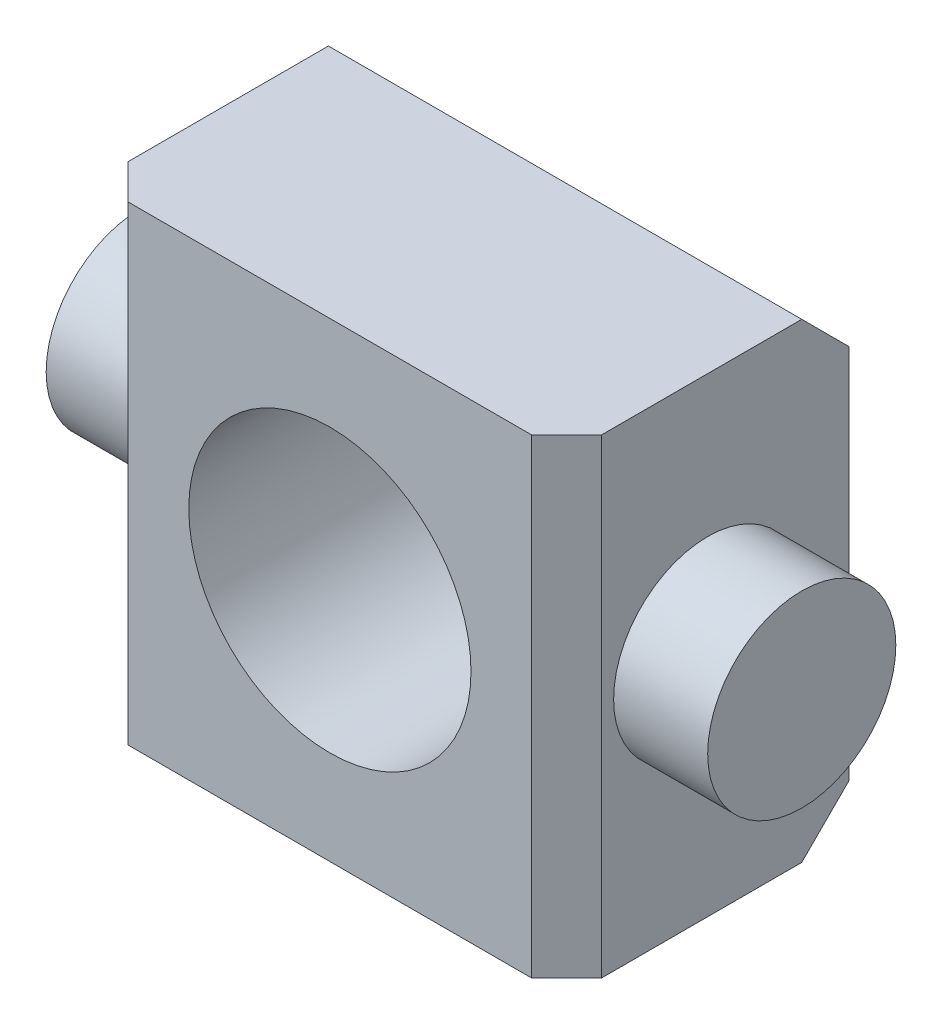
ISO-10303-21;
HEADER;
FILE_DESCRIPTION(('STEP AP214'),'2;1');
FILE_NAME('part.step','',(''),(''),'','','');
FILE_SCHEMA(('AUTOMOTIVE_DESIGN { 1 0 10303 214 1 1 1 1 }'));
ENDSEC;
DATA;
#1=APPLICATION_CONTEXT('core data for automotive mechanical design processes');
#2=APPLICATION_PROTOCOL_DEFINITION('international standard','automotive_design',2000,#1);
#3=PRODUCT_CONTEXT('',#1,'mechanical');
#4=PRODUCT('Part','Part','',(#3));
#5=PRODUCT_RELATED_PRODUCT_CATEGORY('part','',(#4));
#6=PRODUCT_DEFINITION_FORMATION('','',#4);
#7=PRODUCT_DEFINITION_CONTEXT('part definition',#1,'design');
#8=PRODUCT_DEFINITION('design','',#6,#7);
#9=PRODUCT_DEFINITION_SHAPE('','',#8);
#10=(LENGTH_UNIT() NAMED_UNIT(*) SI_UNIT(.MILLI.,.METRE.));
#11=(NAMED_UNIT(*) PLANE_ANGLE_UNIT() SI_UNIT($,.RADIAN.));
#12=(NAMED_UNIT(*) SI_UNIT($,.STERADIAN.) SOLID_ANGLE_UNIT());
#13=UNCERTAINTY_MEASURE_WITH_UNIT(LENGTH_MEASURE(1.E-05),#10,'distance_accuracy_value','');
#14=(GEOMETRIC_REPRESENTATION_CONTEXT(3) GLOBAL_UNCERTAINTY_ASSIGNED_CONTEXT((#13)) GLOBAL_UNIT_ASSIGNED_CONTEXT((#10,
#11,#12)) REPRESENTATION_CONTEXT('',''));
#15=CARTESIAN_POINT('',(0.,0.,0.));
#16=DIRECTION('',(0.,0.,1.));
#17=DIRECTION('',(1.,0.,0.));
#18=AXIS2_PLACEMENT_3D('',#15,#16,#17);
#19=CARTESIAN_POINT('',(-15.9766,15.875,9.525));
#20=DIRECTION('',(1.,0.,0.));
#21=DIRECTION('',(0.,1.,0.));
#22=AXIS2_PLACEMENT_3D('',#19,#20,#21);
#23=PLANE('',#22);
#24=DIRECTION('',(0.,0.,-1.));
#25=VECTOR('',#24,1.);
#26=CARTESIAN_POINT('',(-15.9766,-15.875,9.525));
#27=LINE('',#26,#25);
#28=CARTESIAN_POINT('',(-15.9766,-15.875,7.16279999999999));
#29=VERTEX_POINT('',#28);
#30=CARTESIAN_POINT('',(-15.9766,-15.875,-6.35));
#31=VERTEX_POINT('',#30);
#32=EDGE_CURVE('E129',#29,#31,#27,.T.);
#33=ORIENTED_EDGE('',*,*,#32,.F.);
#34=DIRECTION('',(0.,1.,0.));
#35=VECTOR('',#34,1.);
#36=CARTESIAN_POINT('',(-15.9766,15.875,7.16279999999999));
#37=LINE('',#36,#35);
#38=CARTESIAN_POINT('',(-15.9766,15.875,7.16279999999999));
#39=VERTEX_POINT('',#38);
#40=EDGE_CURVE('E11',#29,#39,#37,.T.);
#41=ORIENTED_EDGE('',*,*,#40,.T.);
#42=DIRECTION('',(0.,0.,-1.));
#43=VECTOR('',#42,1.);
#44=CARTESIAN_POINT('',(-15.9766,15.875,9.525));
#45=LINE('',#44,#43);
#46=CARTESIAN_POINT('',(-15.9766,15.875,-6.35));
#47=VERTEX_POINT('',#46);
#48=EDGE_CURVE('E98',#39,#47,#45,.T.);
#49=ORIENTED_EDGE('',*,*,#48,.T.);
#50=DIRECTION('',(0.,0.707106781186549,0.707106781186546));
#51=VECTOR('',#50,1.);
#52=CARTESIAN_POINT('',(-15.9766,15.875,-6.35));
#53=LINE('',#52,#51);
#54=CARTESIAN_POINT('',(-15.9766,12.7,-9.525));
#55=VERTEX_POINT('',#54);
#56=EDGE_CURVE('E102',#47,#55,#53,.F.);
#57=ORIENTED_EDGE('',*,*,#56,.T.);
#58=DIRECTION('',(0.,-1.,0.));
#59=VECTOR('',#58,1.);
#60=CARTESIAN_POINT('',(-15.9766,15.875,-9.525));
#61=LINE('',#60,#59);
#62=CARTESIAN_POINT('',(-15.9766,-12.7,-9.525));
#63=VERTEX_POINT('',#62);
#64=EDGE_CURVE('E174',#55,#63,#61,.T.);
#65=ORIENTED_EDGE('',*,*,#64,.T.);
#66=DIRECTION('',(0.,0.707106781186549,-0.707106781186546));
#67=VECTOR('',#66,1.);
#68=CARTESIAN_POINT('',(-15.9766,-15.875,-6.35));
#69=LINE('',#68,#67);
#70=EDGE_CURVE('E119',#63,#31,#69,.F.);
#71=ORIENTED_EDGE('',*,*,#70,.T.);
#72=EDGE_LOOP('',(#33,#41,#49,#57,#65,#71));
#73=FACE_BOUND('',#72,.T.);
#74=CARTESIAN_POINT('',(-15.9766,0.,0.));
#75=DIRECTION('',(1.,0.,0.));
#76=DIRECTION('',(0.,1.,0.));
#77=AXIS2_PLACEMENT_3D('',#74,#75,#76);
#78=CIRCLE('',#77,6.35);
#79=CARTESIAN_POINT('',(-15.9766,6.35,0.));
#80=VERTEX_POINT('',#79);
#81=EDGE_CURVE('E124',#80,#80,#78,.F.);
#82=ORIENTED_EDGE('',*,*,#81,.F.);
#83=EDGE_LOOP('',(#82));
#84=FACE_BOUND('',#83,.T.);
#85=ADVANCED_FACE('F34',(#73,#84),#23,.F.);
#86=CARTESIAN_POINT('',(-15.9766,-15.875,9.525));
#87=DIRECTION('',(0.,1.,0.));
#88=DIRECTION('',(0.,0.,1.));
#89=AXIS2_PLACEMENT_3D('',#86,#87,#88);
#90=PLANE('',#89);
#91=DIRECTION('',(0.,0.,-1.));
#92=VECTOR('',#91,1.);
#93=CARTESIAN_POINT('',(15.9766,-15.875,9.525));
#94=LINE('',#93,#92);
#95=CARTESIAN_POINT('',(15.9766,-15.875,7.16279999999999));
#96=VERTEX_POINT('',#95);
#97=CARTESIAN_POINT('',(15.9766,-15.875,-6.35));
#98=VERTEX_POINT('',#97);
#99=EDGE_CURVE('E157',#96,#98,#94,.T.);
#100=ORIENTED_EDGE('',*,*,#99,.F.);
#101=DIRECTION('',(-0.707106781186547,0.,0.707106781186547));
#102=VECTOR('',#101,1.);
#103=CARTESIAN_POINT('',(13.6144,-15.875,9.525));
#104=LINE('',#103,#102);
#105=CARTESIAN_POINT('',(13.6144,-15.875,9.525));
#106=VERTEX_POINT('',#105);
#107=EDGE_CURVE('E42',#96,#106,#104,.T.);
#108=ORIENTED_EDGE('',*,*,#107,.T.);
#109=DIRECTION('',(1.,0.,0.));
#110=VECTOR('',#109,1.);
#111=CARTESIAN_POINT('',(-15.9766,-15.875,9.525));
#112=LINE('',#111,#110);
#113=CARTESIAN_POINT('',(-13.6144,-15.875,9.525));
#114=VERTEX_POINT('',#113);
#115=EDGE_CURVE('E156',#114,#106,#112,.T.);
#116=ORIENTED_EDGE('',*,*,#115,.F.);
#117=DIRECTION('',(-0.707106781186547,0.,-0.707106781186547));
#118=VECTOR('',#117,1.);
#119=CARTESIAN_POINT('',(-13.6144,-15.875,9.525));
#120=LINE('',#119,#118);
#121=EDGE_CURVE('E49',#114,#29,#120,.T.);
#122=ORIENTED_EDGE('',*,*,#121,.T.);
#123=ORIENTED_EDGE('',*,*,#32,.T.);
#124=DIRECTION('',(1.,0.,0.));
#125=VECTOR('',#124,1.);
#126=CARTESIAN_POINT('',(-15.9766,-15.875,-6.35));
#127=LINE('',#126,#125);
#128=EDGE_CURVE('E139',#31,#98,#127,.T.);
#129=ORIENTED_EDGE('',*,*,#128,.T.);
#130=EDGE_LOOP('',(#100,#108,#116,#122,#123,#129));
#131=FACE_BOUND('',#130,.T.);
#132=ADVANCED_FACE('F155',(#131),#90,.F.);
#133=CARTESIAN_POINT('',(15.9766,15.875,9.525));
#134=DIRECTION('',(-1.,0.,0.));
#135=DIRECTION('',(0.,-1.,0.));
#136=AXIS2_PLACEMENT_3D('',#133,#134,#135);
#137=PLANE('',#136);
#138=CARTESIAN_POINT('',(15.9766,0.,0.));
#139=DIRECTION('',(-1.,0.,0.));
#140=DIRECTION('',(0.,-1.,0.));
#141=AXIS2_PLACEMENT_3D('',#138,#139,#140);
#142=CIRCLE('',#141,6.35);
#143=CARTESIAN_POINT('',(15.9766,-6.35,0.));
#144=VERTEX_POINT('',#143);
#145=EDGE_CURVE('E189',#144,#144,#142,.T.);
#146=ORIENTED_EDGE('',*,*,#145,.T.);
#147=EDGE_LOOP('',(#146));
#148=FACE_BOUND('',#147,.T.);
#149=DIRECTION('',(0.,0.,-1.));
#150=VECTOR('',#149,1.);
#151=CARTESIAN_POINT('',(15.9766,15.875,9.525));
#152=LINE('',#151,#150);
#153=CARTESIAN_POINT('',(15.9766,15.875,7.16279999999999));
#154=VERTEX_POINT('',#153);
#155=CARTESIAN_POINT('',(15.9766,15.875,-6.35));
#156=VERTEX_POINT('',#155);
#157=EDGE_CURVE('E108',#154,#156,#152,.T.);
#158=ORIENTED_EDGE('',*,*,#157,.F.);
#159=DIRECTION('',(0.,-1.,0.));
#160=VECTOR('',#159,1.);
#161=CARTESIAN_POINT('',(15.9766,-15.875,7.16279999999999));
#162=LINE('',#161,#160);
#163=EDGE_CURVE('E57',#154,#96,#162,.T.);
#164=ORIENTED_EDGE('',*,*,#163,.T.);
#165=ORIENTED_EDGE('',*,*,#99,.T.);
#166=DIRECTION('',(0.,-0.707106781186549,0.707106781186546));
#167=VECTOR('',#166,1.);
#168=CARTESIAN_POINT('',(15.9766,-15.875,-6.35));
#169=LINE('',#168,#167);
#170=CARTESIAN_POINT('',(15.9766,-12.7,-9.525));
#171=VERTEX_POINT('',#170);
#172=EDGE_CURVE('E135',#98,#171,#169,.F.);
#173=ORIENTED_EDGE('',*,*,#172,.T.);
#174=DIRECTION('',(0.,1.,0.));
#175=VECTOR('',#174,1.);
#176=CARTESIAN_POINT('',(15.9766,15.875,-9.525));
#177=LINE('',#176,#175);
#178=CARTESIAN_POINT('',(15.9766,12.7,-9.525));
#179=VERTEX_POINT('',#178);
#180=EDGE_CURVE('E164',#171,#179,#177,.T.);
#181=ORIENTED_EDGE('',*,*,#180,.T.);
#182=DIRECTION('',(0.,-0.707106781186549,-0.707106781186546));
#183=VECTOR('',#182,1.);
#184=CARTESIAN_POINT('',(15.9766,15.875,-6.35));
#185=LINE('',#184,#183);
#186=EDGE_CURVE('E137',#179,#156,#185,.F.);
#187=ORIENTED_EDGE('',*,*,#186,.T.);
#188=EDGE_LOOP('',(#158,#164,#165,#173,#181,#187));
#189=FACE_BOUND('',#188,.T.);
#190=ADVANCED_FACE('F167',(#148,#189),#137,.F.);
#191=CARTESIAN_POINT('',(-15.9766,15.875,9.525));
#192=DIRECTION('',(0.,-1.,0.));
#193=DIRECTION('',(0.,0.,-1.));
#194=AXIS2_PLACEMENT_3D('',#191,#192,#193);
#195=PLANE('',#194);
#196=DIRECTION('',(-1.,0.,0.));
#197=VECTOR('',#196,1.);
#198=CARTESIAN_POINT('',(-15.9766,15.875,9.525));
#199=LINE('',#198,#197);
#200=CARTESIAN_POINT('',(13.6144,15.875,9.525));
#201=VERTEX_POINT('',#200);
#202=CARTESIAN_POINT('',(-13.6144,15.875,9.525));
#203=VERTEX_POINT('',#202);
#204=EDGE_CURVE('E109',#201,#203,#199,.T.);
#205=ORIENTED_EDGE('',*,*,#204,.F.);
#206=DIRECTION('',(0.707106781186547,0.,-0.707106781186547));
#207=VECTOR('',#206,1.);
#208=CARTESIAN_POINT('',(13.6144,15.875,9.525));
#209=LINE('',#208,#207);
#210=EDGE_CURVE('E150',#201,#154,#209,.T.);
#211=ORIENTED_EDGE('',*,*,#210,.T.);
#212=ORIENTED_EDGE('',*,*,#157,.T.);
#213=DIRECTION('',(-1.,0.,0.));
#214=VECTOR('',#213,1.);
#215=CARTESIAN_POINT('',(-15.9766,15.875,-6.35));
#216=LINE('',#215,#214);
#217=EDGE_CURVE('E116',#156,#47,#216,.T.);
#218=ORIENTED_EDGE('',*,*,#217,.T.);
#219=ORIENTED_EDGE('',*,*,#48,.F.);
#220=DIRECTION('',(0.707106781186547,0.,0.707106781186547));
#221=VECTOR('',#220,1.);
#222=CARTESIAN_POINT('',(-13.6144,15.875,9.525));
#223=LINE('',#222,#221);
#224=EDGE_CURVE('E148',#39,#203,#223,.T.);
#225=ORIENTED_EDGE('',*,*,#224,.T.);
#226=EDGE_LOOP('',(#205,#211,#212,#218,#219,#225));
#227=FACE_BOUND('',#226,.T.);
#228=ADVANCED_FACE('F122',(#227),#195,.F.);
#229=CARTESIAN_POINT('',(-15.9766,-15.875,9.525));
#230=DIRECTION('',(0.,0.,1.));
#231=DIRECTION('',(1.,0.,0.));
#232=AXIS2_PLACEMENT_3D('',#229,#230,#231);
#233=PLANE('',#232);
#234=CARTESIAN_POINT('',(0.,0.,9.525));
#235=DIRECTION('',(0.,0.,1.));
#236=DIRECTION('',(1.,0.,0.));
#237=AXIS2_PLACEMENT_3D('',#234,#235,#236);
#238=CIRCLE('',#237,9.52499999999999);
#239=CARTESIAN_POINT('',(9.52499999999999,0.,9.525));
#240=VERTEX_POINT('',#239);
#241=EDGE_CURVE('E197',#240,#240,#238,.T.);
#242=ORIENTED_EDGE('',*,*,#241,.F.);
#243=EDGE_LOOP('',(#242));
#244=FACE_BOUND('',#243,.T.);
#245=ORIENTED_EDGE('',*,*,#115,.T.);
#246=DIRECTION('',(0.,1.,0.));
#247=VECTOR('',#246,1.);
#248=CARTESIAN_POINT('',(13.6144,15.875,9.525));
#249=LINE('',#248,#247);
#250=EDGE_CURVE('E145',#106,#201,#249,.T.);
#251=ORIENTED_EDGE('',*,*,#250,.T.);
#252=ORIENTED_EDGE('',*,*,#204,.T.);
#253=DIRECTION('',(0.,-1.,0.));
#254=VECTOR('',#253,1.);
#255=CARTESIAN_POINT('',(-13.6144,-15.875,9.525));
#256=LINE('',#255,#254);
#257=EDGE_CURVE('E142',#203,#114,#256,.T.);
#258=ORIENTED_EDGE('',*,*,#257,.T.);
#259=EDGE_LOOP('',(#245,#251,#252,#258));
#260=FACE_BOUND('',#259,.T.);
#261=ADVANCED_FACE('F161',(#244,#260),#233,.T.);
#262=CARTESIAN_POINT('',(-15.9766,-15.875,-9.525));
#263=DIRECTION('',(0.,0.,1.));
#264=DIRECTION('',(1.,0.,0.));
#265=AXIS2_PLACEMENT_3D('',#262,#263,#264);
#266=PLANE('',#265);
#267=CARTESIAN_POINT('',(0.,0.,-9.525));
#268=DIRECTION('',(0.,0.,1.));
#269=DIRECTION('',(1.,0.,0.));
#270=AXIS2_PLACEMENT_3D('',#267,#268,#269);
#271=CIRCLE('',#270,9.525);
#272=CARTESIAN_POINT('',(9.525,0.,-9.525));
#273=VERTEX_POINT('',#272);
#274=EDGE_CURVE('E192',#273,#273,#271,.T.);
#275=ORIENTED_EDGE('',*,*,#274,.T.);
#276=EDGE_LOOP('',(#275));
#277=FACE_BOUND('',#276,.T.);
#278=ORIENTED_EDGE('',*,*,#64,.F.);
#279=DIRECTION('',(1.,0.,0.));
#280=VECTOR('',#279,1.);
#281=CARTESIAN_POINT('',(-15.9766,12.7,-9.525));
#282=LINE('',#281,#280);
#283=EDGE_CURVE('E117',#55,#179,#282,.T.);
#284=ORIENTED_EDGE('',*,*,#283,.T.);
#285=ORIENTED_EDGE('',*,*,#180,.F.);
#286=DIRECTION('',(-1.,0.,0.));
#287=VECTOR('',#286,1.);
#288=CARTESIAN_POINT('',(-15.9766,-12.7,-9.525));
#289=LINE('',#288,#287);
#290=EDGE_CURVE('E118',#171,#63,#289,.T.);
#291=ORIENTED_EDGE('',*,*,#290,.T.);
#292=EDGE_LOOP('',(#278,#284,#285,#291));
#293=FACE_BOUND('',#292,.T.);
#294=ADVANCED_FACE('F181',(#277,#293),#266,.F.);
#295=CARTESIAN_POINT('',(-22.3266,0.,0.));
#296=DIRECTION('',(1.,0.,0.));
#297=DIRECTION('',(0.,1.,0.));
#298=AXIS2_PLACEMENT_3D('',#295,#296,#297);
#299=CYLINDRICAL_SURFACE('',#298,6.35);
#300=CARTESIAN_POINT('',(-22.3266,0.,0.));
#301=DIRECTION('',(-1.,0.,0.));
#302=DIRECTION('',(0.,-1.,0.));
#303=AXIS2_PLACEMENT_3D('',#300,#301,#302);
#304=CIRCLE('',#303,6.35);
#305=CARTESIAN_POINT('',(-22.3266,-6.35,0.));
#306=VERTEX_POINT('',#305);
#307=EDGE_CURVE('E182',#306,#306,#304,.T.);
#308=ORIENTED_EDGE('',*,*,#307,.F.);
#309=EDGE_LOOP('',(#308));
#310=FACE_BOUND('',#309,.T.);
#311=ORIENTED_EDGE('',*,*,#81,.T.);
#312=EDGE_LOOP('',(#311));
#313=FACE_BOUND('',#312,.T.);
#314=ADVANCED_FACE('F209',(#310,#313),#299,.T.);
#315=CARTESIAN_POINT('',(-22.3266,0.,0.));
#316=DIRECTION('',(-1.,0.,0.));
#317=DIRECTION('',(0.,-1.,0.));
#318=AXIS2_PLACEMENT_3D('',#315,#316,#317);
#319=PLANE('',#318);
#320=ORIENTED_EDGE('',*,*,#307,.T.);
#321=EDGE_LOOP('',(#320));
#322=FACE_BOUND('',#321,.T.);
#323=ADVANCED_FACE('F244',(#322),#319,.T.);
#324=CARTESIAN_POINT('',(22.3266,0.,0.));
#325=DIRECTION('',(-1.,0.,0.));
#326=DIRECTION('',(0.,-1.,0.));
#327=AXIS2_PLACEMENT_3D('',#324,#325,#326);
#328=CYLINDRICAL_SURFACE('',#327,6.35);
#329=CARTESIAN_POINT('',(22.3266,0.,0.));
#330=DIRECTION('',(-1.,0.,0.));
#331=DIRECTION('',(0.,-1.,0.));
#332=AXIS2_PLACEMENT_3D('',#329,#330,#331);
#333=CIRCLE('',#332,6.35);
#334=CARTESIAN_POINT('',(22.3266,-6.35,0.));
#335=VERTEX_POINT('',#334);
#336=EDGE_CURVE('E188',#335,#335,#333,.T.);
#337=ORIENTED_EDGE('',*,*,#336,.T.);
#338=EDGE_LOOP('',(#337));
#339=FACE_BOUND('',#338,.T.);
#340=ORIENTED_EDGE('',*,*,#145,.F.);
#341=EDGE_LOOP('',(#340));
#342=FACE_BOUND('',#341,.T.);
#343=ADVANCED_FACE('F240',(#339,#342),#328,.T.);
#344=CARTESIAN_POINT('',(22.3266,0.,0.));
#345=DIRECTION('',(1.,0.,0.));
#346=DIRECTION('',(0.,-1.,0.));
#347=AXIS2_PLACEMENT_3D('',#344,#345,#346);
#348=PLANE('',#347);
#349=ORIENTED_EDGE('',*,*,#336,.F.);
#350=EDGE_LOOP('',(#349));
#351=FACE_BOUND('',#350,.T.);
#352=ADVANCED_FACE('F224',(#351),#348,.T.);
#353=CARTESIAN_POINT('',(-15.9766,15.875,-6.35));
#354=DIRECTION('',(0.,-0.707106781186546,0.707106781186549));
#355=DIRECTION('',(0.,-0.707106781186549,-0.707106781186546));
#356=AXIS2_PLACEMENT_3D('',#353,#354,#355);
#357=PLANE('',#356);
#358=ORIENTED_EDGE('',*,*,#186,.F.);
#359=ORIENTED_EDGE('',*,*,#283,.F.);
#360=ORIENTED_EDGE('',*,*,#56,.F.);
#361=ORIENTED_EDGE('',*,*,#217,.F.);
#362=EDGE_LOOP('',(#358,#359,#360,#361));
#363=FACE_BOUND('',#362,.T.);
#364=ADVANCED_FACE('F115',(#363),#357,.F.);
#365=CARTESIAN_POINT('',(-15.9766,-15.875,-6.35));
#366=DIRECTION('',(0.,0.707106781186546,0.707106781186549));
#367=DIRECTION('',(0.,-0.707106781186549,0.707106781186546));
#368=AXIS2_PLACEMENT_3D('',#365,#366,#367);
#369=PLANE('',#368);
#370=ORIENTED_EDGE('',*,*,#70,.F.);
#371=ORIENTED_EDGE('',*,*,#290,.F.);
#372=ORIENTED_EDGE('',*,*,#172,.F.);
#373=ORIENTED_EDGE('',*,*,#128,.F.);
#374=EDGE_LOOP('',(#370,#371,#372,#373));
#375=FACE_BOUND('',#374,.T.);
#376=ADVANCED_FACE('F178',(#375),#369,.F.);
#377=CARTESIAN_POINT('',(0.,0.,9.525));
#378=DIRECTION('',(0.,0.,1.));
#379=DIRECTION('',(1.,0.,0.));
#380=AXIS2_PLACEMENT_3D('',#377,#378,#379);
#381=CYLINDRICAL_SURFACE('',#380,9.52499999999999);
#382=ORIENTED_EDGE('',*,*,#274,.F.);
#383=EDGE_LOOP('',(#382));
#384=FACE_BOUND('',#383,.T.);
#385=ORIENTED_EDGE('',*,*,#241,.T.);
#386=EDGE_LOOP('',(#385));
#387=FACE_BOUND('',#386,.T.);
#388=ADVANCED_FACE('F201',(#384,#387),#381,.F.);
#389=CARTESIAN_POINT('',(13.6144,-15.875,9.525));
#390=DIRECTION('',(0.707106781186547,0.,0.707106781186547));
#391=DIRECTION('',(0.707106781186548,0.,-0.707106781186548));
#392=AXIS2_PLACEMENT_3D('',#389,#390,#391);
#393=PLANE('',#392);
#394=ORIENTED_EDGE('',*,*,#107,.F.);
#395=ORIENTED_EDGE('',*,*,#163,.F.);
#396=ORIENTED_EDGE('',*,*,#210,.F.);
#397=ORIENTED_EDGE('',*,*,#250,.F.);
#398=EDGE_LOOP('',(#394,#395,#396,#397));
#399=FACE_BOUND('',#398,.T.);
#400=ADVANCED_FACE('F166',(#399),#393,.T.);
#401=CARTESIAN_POINT('',(-13.6144,-15.875,9.525));
#402=DIRECTION('',(-0.707106781186547,0.,0.707106781186547));
#403=DIRECTION('',(0.707106781186548,0.,0.707106781186548));
#404=AXIS2_PLACEMENT_3D('',#401,#402,#403);
#405=PLANE('',#404);
#406=ORIENTED_EDGE('',*,*,#224,.F.);
#407=ORIENTED_EDGE('',*,*,#40,.F.);
#408=ORIENTED_EDGE('',*,*,#121,.F.);
#409=ORIENTED_EDGE('',*,*,#257,.F.);
#410=EDGE_LOOP('',(#406,#407,#408,#409));
#411=FACE_BOUND('',#410,.T.);
#412=ADVANCED_FACE('F36',(#411),#405,.T.);
#413=CLOSED_SHELL('',(#85,#132,#190,#228,#261,#294,#314,#323,#343,#352,#364,#376,#388,#400,#412));
#414=MANIFOLD_SOLID_BREP('B2',#413);
#415=ADVANCED_BREP_SHAPE_REPRESENTATION('',(#18,#414),#14);
#416=SHAPE_DEFINITION_REPRESENTATION(#9,#415);
ENDSEC;
END-ISO-10303-21;
